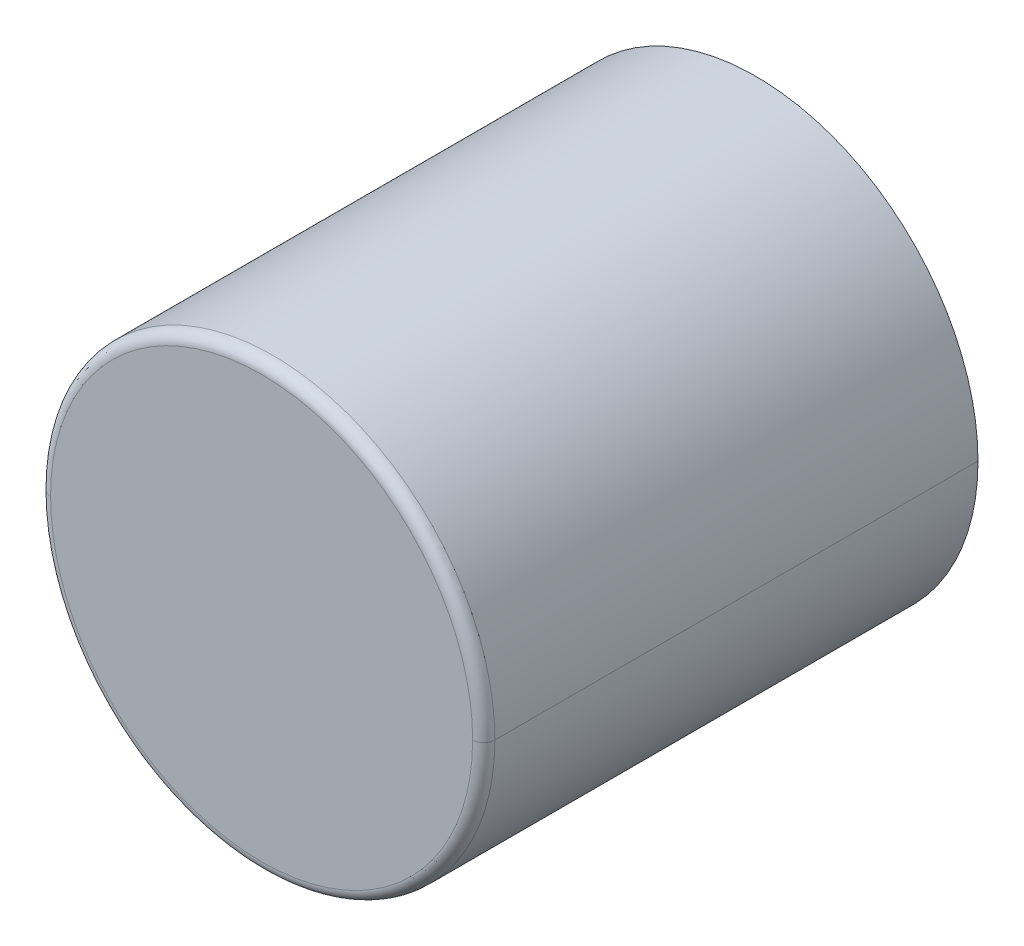
ISO-10303-21;
HEADER;
FILE_DESCRIPTION(('STEP AP214'),'2;1');
FILE_NAME('part.step','',(''),(''),'','','');
FILE_SCHEMA(('AUTOMOTIVE_DESIGN { 1 0 10303 214 1 1 1 1 }'));
ENDSEC;
DATA;
#1=APPLICATION_CONTEXT('core data for automotive mechanical design processes');
#2=APPLICATION_PROTOCOL_DEFINITION('international standard','automotive_design',2000,#1);
#3=PRODUCT_CONTEXT('',#1,'mechanical');
#4=PRODUCT('Part','Part','',(#3));
#5=PRODUCT_RELATED_PRODUCT_CATEGORY('part','',(#4));
#6=PRODUCT_DEFINITION_FORMATION('','',#4);
#7=PRODUCT_DEFINITION_CONTEXT('part definition',#1,'design');
#8=PRODUCT_DEFINITION('design','',#6,#7);
#9=PRODUCT_DEFINITION_SHAPE('','',#8);
#10=(LENGTH_UNIT() NAMED_UNIT(*) SI_UNIT(.MILLI.,.METRE.));
#11=(NAMED_UNIT(*) PLANE_ANGLE_UNIT() SI_UNIT($,.RADIAN.));
#12=(NAMED_UNIT(*) SI_UNIT($,.STERADIAN.) SOLID_ANGLE_UNIT());
#13=UNCERTAINTY_MEASURE_WITH_UNIT(LENGTH_MEASURE(1.E-05),#10,'distance_accuracy_value','');
#14=(GEOMETRIC_REPRESENTATION_CONTEXT(3) GLOBAL_UNCERTAINTY_ASSIGNED_CONTEXT((#13)) GLOBAL_UNIT_ASSIGNED_CONTEXT((#10,
#11,#12)) REPRESENTATION_CONTEXT('',''));
#15=CARTESIAN_POINT('',(0.,0.,0.));
#16=DIRECTION('',(0.,0.,1.));
#17=DIRECTION('',(1.,0.,0.));
#18=AXIS2_PLACEMENT_3D('',#15,#16,#17);
#19=CARTESIAN_POINT('',(4.15,4.494149457923,1.6));
#20=DIRECTION('',(0.,0.,-1.));
#21=DIRECTION('',(0.,-1.,0.));
#22=AXIS2_PLACEMENT_3D('',#19,#20,#21);
#23=PLANE('',#22);
#24=CARTESIAN_POINT('',(4.15,4.494149457923,1.6));
#25=DIRECTION('',(0.,0.,-1.));
#26=DIRECTION('',(-1.,0.,0.));
#27=AXIS2_PLACEMENT_3D('',#24,#25,#26);
#28=CIRCLE('',#27,4.);
#29=CARTESIAN_POINT('',(8.15,4.494149457923,1.6));
#30=VERTEX_POINT('',#29);
#31=CARTESIAN_POINT('',(0.15,4.494149457923,1.6));
#32=VERTEX_POINT('',#31);
#33=EDGE_CURVE('E20',#30,#32,#28,.T.);
#34=ORIENTED_EDGE('',*,*,#33,.T.);
#35=CARTESIAN_POINT('',(4.15,4.494149457923,1.6));
#36=DIRECTION('',(0.,0.,-1.));
#37=DIRECTION('',(-1.,0.,0.));
#38=AXIS2_PLACEMENT_3D('',#35,#36,#37);
#39=CIRCLE('',#38,4.);
#40=EDGE_CURVE('E11',#32,#30,#39,.T.);
#41=ORIENTED_EDGE('',*,*,#40,.T.);
#42=EDGE_LOOP('',(#34,#41));
#43=FACE_BOUND('',#42,.T.);
#44=ADVANCED_FACE('F16',(#43),#23,.T.);
#45=CARTESIAN_POINT('',(4.15,4.494149457923,10.5));
#46=DIRECTION('',(0.,0.,-1.));
#47=DIRECTION('',(0.,-1.,0.));
#48=AXIS2_PLACEMENT_3D('',#45,#46,#47);
#49=PLANE('',#48);
#50=CARTESIAN_POINT('',(4.15,4.494149457923,10.5));
#51=DIRECTION('',(0.,0.,-1.));
#52=DIRECTION('',(-1.,0.,0.));
#53=AXIS2_PLACEMENT_3D('',#50,#51,#52);
#54=CIRCLE('',#53,3.8);
#55=CARTESIAN_POINT('',(7.95,4.494149457923,10.5));
#56=VERTEX_POINT('',#55);
#57=CARTESIAN_POINT('',(0.35,4.494149457923,10.5));
#58=VERTEX_POINT('',#57);
#59=EDGE_CURVE('E27',#56,#58,#54,.T.);
#60=ORIENTED_EDGE('',*,*,#59,.F.);
#61=CARTESIAN_POINT('',(4.15,4.494149457923,10.5));
#62=DIRECTION('',(0.,0.,-1.));
#63=DIRECTION('',(-1.,0.,0.));
#64=AXIS2_PLACEMENT_3D('',#61,#62,#63);
#65=CIRCLE('',#64,3.8);
#66=EDGE_CURVE('E75',#58,#56,#65,.T.);
#67=ORIENTED_EDGE('',*,*,#66,.F.);
#68=EDGE_LOOP('',(#60,#67));
#69=FACE_BOUND('',#68,.T.);
#70=ADVANCED_FACE('F18',(#69),#49,.F.);
#71=CARTESIAN_POINT('',(4.15,4.494149457923,1.6));
#72=DIRECTION('',(0.,0.,-1.));
#73=DIRECTION('',(-1.,0.,0.));
#74=AXIS2_PLACEMENT_3D('',#71,#72,#73);
#75=CYLINDRICAL_SURFACE('',#74,4.);
#76=DIRECTION('',(0.,0.,1.));
#77=VECTOR('',#76,1.);
#78=CARTESIAN_POINT('',(0.15,4.494149457923,1.6));
#79=LINE('',#78,#77);
#80=CARTESIAN_POINT('',(0.15,4.494149457923,10.3));
#81=VERTEX_POINT('',#80);
#82=EDGE_CURVE('E65',#32,#81,#79,.T.);
#83=ORIENTED_EDGE('',*,*,#82,.T.);
#84=CARTESIAN_POINT('',(4.15,4.494149457923,10.3));
#85=DIRECTION('',(0.,0.,1.));
#86=DIRECTION('',(-1.,0.,0.));
#87=AXIS2_PLACEMENT_3D('',#84,#85,#86);
#88=CIRCLE('',#87,4.);
#89=CARTESIAN_POINT('',(8.15,4.494149457923,10.3));
#90=VERTEX_POINT('',#89);
#91=EDGE_CURVE('E58',#90,#81,#88,.T.);
#92=ORIENTED_EDGE('',*,*,#91,.F.);
#93=DIRECTION('',(0.,0.,-1.));
#94=VECTOR('',#93,1.);
#95=CARTESIAN_POINT('',(8.15,4.494149457923,1.6));
#96=LINE('',#95,#94);
#97=EDGE_CURVE('E62',#90,#30,#96,.T.);
#98=ORIENTED_EDGE('',*,*,#97,.T.);
#99=ORIENTED_EDGE('',*,*,#40,.F.);
#100=EDGE_LOOP('',(#83,#92,#98,#99));
#101=FACE_BOUND('',#100,.T.);
#102=ADVANCED_FACE('F60',(#101),#75,.T.);
#103=CARTESIAN_POINT('',(4.15,4.494149457923,10.3));
#104=DIRECTION('',(0.,0.,-1.));
#105=DIRECTION('',(-1.,0.,0.));
#106=AXIS2_PLACEMENT_3D('',#103,#104,#105);
#107=TOROIDAL_SURFACE('',#106,3.8,0.2);
#108=CARTESIAN_POINT('',(0.35,4.494149457923,10.3));
#109=DIRECTION('',(0.,-1.,0.));
#110=DIRECTION('',(-1.,0.,0.));
#111=AXIS2_PLACEMENT_3D('',#108,#109,#110);
#112=CIRCLE('',#111,0.2);
#113=EDGE_CURVE('E82',#58,#81,#112,.T.);
#114=ORIENTED_EDGE('',*,*,#113,.T.);
#115=CARTESIAN_POINT('',(4.15,4.494149457923,10.3));
#116=DIRECTION('',(0.,0.,1.));
#117=DIRECTION('',(-1.,0.,0.));
#118=AXIS2_PLACEMENT_3D('',#115,#116,#117);
#119=CIRCLE('',#118,4.);
#120=EDGE_CURVE('E80',#81,#90,#119,.T.);
#121=ORIENTED_EDGE('',*,*,#120,.T.);
#122=CARTESIAN_POINT('',(7.95,4.494149457923,10.3));
#123=DIRECTION('',(0.,-1.,0.));
#124=DIRECTION('',(1.,0.,0.));
#125=AXIS2_PLACEMENT_3D('',#122,#123,#124);
#126=CIRCLE('',#125,0.2);
#127=EDGE_CURVE('E70',#90,#56,#126,.T.);
#128=ORIENTED_EDGE('',*,*,#127,.T.);
#129=ORIENTED_EDGE('',*,*,#59,.T.);
#130=EDGE_LOOP('',(#114,#121,#128,#129));
#131=FACE_BOUND('',#130,.T.);
#132=ADVANCED_FACE('F81',(#131),#107,.T.);
#133=CARTESIAN_POINT('',(4.15,4.494149457923,10.3));
#134=DIRECTION('',(0.,0.,-1.));
#135=DIRECTION('',(-1.,0.,0.));
#136=AXIS2_PLACEMENT_3D('',#133,#134,#135);
#137=TOROIDAL_SURFACE('',#136,3.8,0.2);
#138=ORIENTED_EDGE('',*,*,#113,.F.);
#139=ORIENTED_EDGE('',*,*,#66,.T.);
#140=ORIENTED_EDGE('',*,*,#127,.F.);
#141=ORIENTED_EDGE('',*,*,#91,.T.);
#142=EDGE_LOOP('',(#138,#139,#140,#141));
#143=FACE_BOUND('',#142,.T.);
#144=ADVANCED_FACE('F74',(#143),#137,.T.);
#145=CARTESIAN_POINT('',(4.15,4.494149457923,1.6));
#146=DIRECTION('',(0.,0.,-1.));
#147=DIRECTION('',(-1.,0.,0.));
#148=AXIS2_PLACEMENT_3D('',#145,#146,#147);
#149=CYLINDRICAL_SURFACE('',#148,4.);
#150=ORIENTED_EDGE('',*,*,#82,.F.);
#151=ORIENTED_EDGE('',*,*,#33,.F.);
#152=ORIENTED_EDGE('',*,*,#97,.F.);
#153=ORIENTED_EDGE('',*,*,#120,.F.);
#154=EDGE_LOOP('',(#150,#151,#152,#153));
#155=FACE_BOUND('',#154,.T.);
#156=ADVANCED_FACE('F85',(#155),#149,.T.);
#157=CLOSED_SHELL('',(#44,#70,#102,#132,#144,#156));
#158=MANIFOLD_SOLID_BREP('B1',#157);
#159=ADVANCED_BREP_SHAPE_REPRESENTATION('',(#18,#158),#14);
#160=SHAPE_DEFINITION_REPRESENTATION(#9,#159);
ENDSEC;
END-ISO-10303-21;
